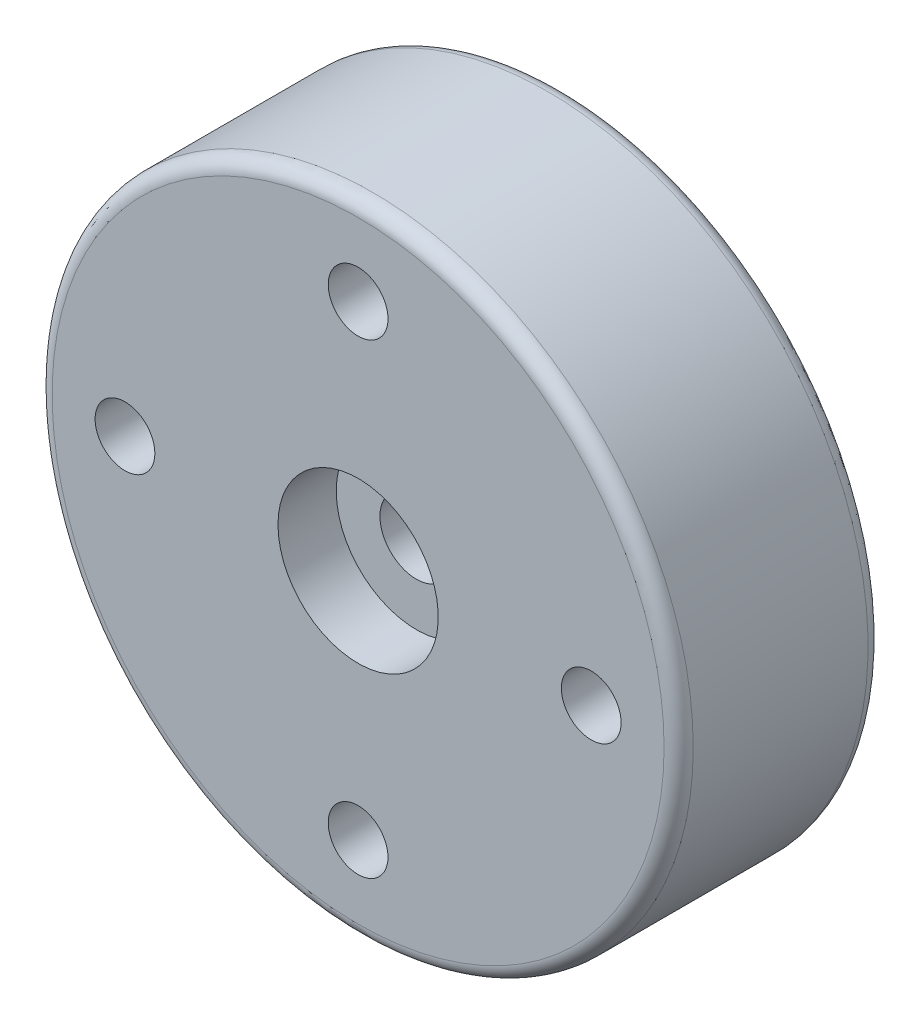
ISO-10303-21;
HEADER;
FILE_DESCRIPTION(('STEP AP214'),'2;1');
FILE_NAME('part.step','',(''),(''),'','','');
FILE_SCHEMA(('AUTOMOTIVE_DESIGN { 1 0 10303 214 1 1 1 1 }'));
ENDSEC;
DATA;
#1=APPLICATION_CONTEXT('core data for automotive mechanical design processes');
#2=APPLICATION_PROTOCOL_DEFINITION('international standard','automotive_design',2000,#1);
#3=PRODUCT_CONTEXT('',#1,'mechanical');
#4=PRODUCT('Part','Part','',(#3));
#5=PRODUCT_RELATED_PRODUCT_CATEGORY('part','',(#4));
#6=PRODUCT_DEFINITION_FORMATION('','',#4);
#7=PRODUCT_DEFINITION_CONTEXT('part definition',#1,'design');
#8=PRODUCT_DEFINITION('design','',#6,#7);
#9=PRODUCT_DEFINITION_SHAPE('','',#8);
#10=(LENGTH_UNIT() NAMED_UNIT(*) SI_UNIT(.MILLI.,.METRE.));
#11=(NAMED_UNIT(*) PLANE_ANGLE_UNIT() SI_UNIT($,.RADIAN.));
#12=(NAMED_UNIT(*) SI_UNIT($,.STERADIAN.) SOLID_ANGLE_UNIT());
#13=UNCERTAINTY_MEASURE_WITH_UNIT(LENGTH_MEASURE(1.E-05),#10,'distance_accuracy_value','');
#14=(GEOMETRIC_REPRESENTATION_CONTEXT(3) GLOBAL_UNCERTAINTY_ASSIGNED_CONTEXT((#13)) GLOBAL_UNIT_ASSIGNED_CONTEXT((#10,
#11,#12)) REPRESENTATION_CONTEXT('',''));
#15=CARTESIAN_POINT('',(0.,0.,0.));
#16=DIRECTION('',(0.,0.,1.));
#17=DIRECTION('',(1.,0.,0.));
#18=AXIS2_PLACEMENT_3D('',#15,#16,#17);
#19=CARTESIAN_POINT('',(0.,0.,0.));
#20=DIRECTION('',(0.,0.,-1.));
#21=DIRECTION('',(-1.,0.,0.));
#22=AXIS2_PLACEMENT_3D('',#19,#20,#21);
#23=CYLINDRICAL_SURFACE('',#22,2.75);
#24=CARTESIAN_POINT('',(0.,0.,-2.));
#25=DIRECTION('',(0.,0.,-1.));
#26=DIRECTION('',(-1.,0.,0.));
#27=AXIS2_PLACEMENT_3D('',#24,#25,#26);
#28=CIRCLE('',#27,2.75);
#29=CARTESIAN_POINT('',(-2.75,0.,-2.));
#30=VERTEX_POINT('',#29);
#31=EDGE_CURVE('E67',#30,#30,#28,.T.);
#32=ORIENTED_EDGE('',*,*,#31,.T.);
#33=EDGE_LOOP('',(#32));
#34=FACE_BOUND('',#33,.T.);
#35=CARTESIAN_POINT('',(0.,0.,0.));
#36=DIRECTION('',(0.,0.,-1.));
#37=DIRECTION('',(-1.,0.,0.));
#38=AXIS2_PLACEMENT_3D('',#35,#36,#37);
#39=CIRCLE('',#38,2.75);
#40=CARTESIAN_POINT('',(-2.75,0.,0.));
#41=VERTEX_POINT('',#40);
#42=EDGE_CURVE('E52',#41,#41,#39,.T.);
#43=ORIENTED_EDGE('',*,*,#42,.F.);
#44=EDGE_LOOP('',(#43));
#45=FACE_BOUND('',#44,.T.);
#46=ADVANCED_FACE('F32',(#34,#45),#23,.F.);
#47=CARTESIAN_POINT('',(0.,2.75,0.));
#48=DIRECTION('',(0.,0.,1.));
#49=DIRECTION('',(1.,0.,0.));
#50=AXIS2_PLACEMENT_3D('',#47,#48,#49);
#51=PLANE('',#50);
#52=CARTESIAN_POINT('',(0.,0.,0.));
#53=DIRECTION('',(0.,0.,1.));
#54=DIRECTION('',(1.,0.,0.));
#55=AXIS2_PLACEMENT_3D('',#52,#53,#54);
#56=CIRCLE('',#55,10.5);
#57=CARTESIAN_POINT('',(10.5,0.,0.));
#58=VERTEX_POINT('',#57);
#59=EDGE_CURVE('E10',#58,#58,#56,.T.);
#60=ORIENTED_EDGE('',*,*,#59,.T.);
#61=EDGE_LOOP('',(#60));
#62=FACE_BOUND('',#61,.T.);
#63=CARTESIAN_POINT('',(0.,8.,0.));
#64=DIRECTION('',(0.,0.,1.));
#65=DIRECTION('',(1.,0.,0.));
#66=AXIS2_PLACEMENT_3D('',#63,#64,#65);
#67=CIRCLE('',#66,1.025);
#68=CARTESIAN_POINT('',(1.025,8.,0.));
#69=VERTEX_POINT('',#68);
#70=EDGE_CURVE('E73',#69,#69,#67,.T.);
#71=ORIENTED_EDGE('',*,*,#70,.F.);
#72=EDGE_LOOP('',(#71));
#73=FACE_BOUND('',#72,.T.);
#74=CARTESIAN_POINT('',(8.,0.,0.));
#75=DIRECTION('',(0.,0.,1.));
#76=DIRECTION('',(1.,0.,0.));
#77=AXIS2_PLACEMENT_3D('',#74,#75,#76);
#78=CIRCLE('',#77,1.025);
#79=CARTESIAN_POINT('',(9.025,0.,0.));
#80=VERTEX_POINT('',#79);
#81=EDGE_CURVE('E85',#80,#80,#78,.T.);
#82=ORIENTED_EDGE('',*,*,#81,.F.);
#83=EDGE_LOOP('',(#82));
#84=FACE_BOUND('',#83,.T.);
#85=CARTESIAN_POINT('',(0.,-8.,0.));
#86=DIRECTION('',(0.,0.,1.));
#87=DIRECTION('',(1.,0.,0.));
#88=AXIS2_PLACEMENT_3D('',#85,#86,#87);
#89=CIRCLE('',#88,1.025);
#90=CARTESIAN_POINT('',(1.025,-8.,0.));
#91=VERTEX_POINT('',#90);
#92=EDGE_CURVE('E91',#91,#91,#89,.T.);
#93=ORIENTED_EDGE('',*,*,#92,.F.);
#94=EDGE_LOOP('',(#93));
#95=FACE_BOUND('',#94,.T.);
#96=CARTESIAN_POINT('',(-8.,0.,0.));
#97=DIRECTION('',(0.,0.,1.));
#98=DIRECTION('',(1.,0.,0.));
#99=AXIS2_PLACEMENT_3D('',#96,#97,#98);
#100=CIRCLE('',#99,1.025);
#101=CARTESIAN_POINT('',(-6.975,0.,0.));
#102=VERTEX_POINT('',#101);
#103=EDGE_CURVE('E79',#102,#102,#100,.T.);
#104=ORIENTED_EDGE('',*,*,#103,.F.);
#105=EDGE_LOOP('',(#104));
#106=FACE_BOUND('',#105,.T.);
#107=ORIENTED_EDGE('',*,*,#42,.T.);
#108=EDGE_LOOP('',(#107));
#109=FACE_BOUND('',#108,.T.);
#110=ADVANCED_FACE('F98',(#62,#73,#84,#95,#106,#109),#51,.T.);
#111=CARTESIAN_POINT('',(0.,0.,0.));
#112=DIRECTION('',(0.,0.,-1.));
#113=DIRECTION('',(-1.,0.,0.));
#114=AXIS2_PLACEMENT_3D('',#111,#112,#113);
#115=CYLINDRICAL_SURFACE('',#114,11.);
#116=CARTESIAN_POINT('',(0.,0.,-6.5));
#117=DIRECTION('',(0.,0.,-1.));
#118=DIRECTION('',(-1.,0.,0.));
#119=AXIS2_PLACEMENT_3D('',#116,#117,#118);
#120=CIRCLE('',#119,11.);
#121=CARTESIAN_POINT('',(-11.,0.,-6.5));
#122=VERTEX_POINT('',#121);
#123=EDGE_CURVE('E39',#122,#122,#120,.F.);
#124=ORIENTED_EDGE('',*,*,#123,.T.);
#125=EDGE_LOOP('',(#124));
#126=FACE_BOUND('',#125,.T.);
#127=CARTESIAN_POINT('',(0.,0.,-0.5));
#128=DIRECTION('',(0.,0.,1.));
#129=DIRECTION('',(1.,0.,0.));
#130=AXIS2_PLACEMENT_3D('',#127,#128,#129);
#131=CIRCLE('',#130,11.);
#132=CARTESIAN_POINT('',(11.,0.,-0.5));
#133=VERTEX_POINT('',#132);
#134=EDGE_CURVE('E43',#133,#133,#131,.F.);
#135=ORIENTED_EDGE('',*,*,#134,.T.);
#136=EDGE_LOOP('',(#135));
#137=FACE_BOUND('',#136,.T.);
#138=ADVANCED_FACE('F101',(#126,#137),#115,.T.);
#139=CARTESIAN_POINT('',(0.,11.,-7.));
#140=DIRECTION('',(0.,0.,-1.));
#141=DIRECTION('',(-1.,0.,0.));
#142=AXIS2_PLACEMENT_3D('',#139,#140,#141);
#143=PLANE('',#142);
#144=CARTESIAN_POINT('',(0.,0.,-7.));
#145=DIRECTION('',(0.,0.,-1.));
#146=DIRECTION('',(-1.,0.,0.));
#147=AXIS2_PLACEMENT_3D('',#144,#145,#146);
#148=CIRCLE('',#147,10.5);
#149=CARTESIAN_POINT('',(-10.5,0.,-7.));
#150=VERTEX_POINT('',#149);
#151=EDGE_CURVE('E47',#150,#150,#148,.T.);
#152=ORIENTED_EDGE('',*,*,#151,.T.);
#153=EDGE_LOOP('',(#152));
#154=FACE_BOUND('',#153,.T.);
#155=CARTESIAN_POINT('',(0.,8.,-7.));
#156=DIRECTION('',(0.,0.,-1.));
#157=DIRECTION('',(-1.,0.,0.));
#158=AXIS2_PLACEMENT_3D('',#155,#156,#157);
#159=CIRCLE('',#158,1.025);
#160=CARTESIAN_POINT('',(-1.025,8.,-7.));
#161=VERTEX_POINT('',#160);
#162=EDGE_CURVE('E70',#161,#161,#159,.F.);
#163=ORIENTED_EDGE('',*,*,#162,.T.);
#164=EDGE_LOOP('',(#163));
#165=FACE_BOUND('',#164,.T.);
#166=CARTESIAN_POINT('',(8.,0.,-7.));
#167=DIRECTION('',(0.,0.,-1.));
#168=DIRECTION('',(-1.,0.,0.));
#169=AXIS2_PLACEMENT_3D('',#166,#167,#168);
#170=CIRCLE('',#169,1.025);
#171=CARTESIAN_POINT('',(6.975,0.,-7.));
#172=VERTEX_POINT('',#171);
#173=EDGE_CURVE('E82',#172,#172,#170,.F.);
#174=ORIENTED_EDGE('',*,*,#173,.T.);
#175=EDGE_LOOP('',(#174));
#176=FACE_BOUND('',#175,.T.);
#177=CARTESIAN_POINT('',(0.,-8.,-7.));
#178=DIRECTION('',(0.,0.,-1.));
#179=DIRECTION('',(-1.,0.,0.));
#180=AXIS2_PLACEMENT_3D('',#177,#178,#179);
#181=CIRCLE('',#180,1.025);
#182=CARTESIAN_POINT('',(-1.025,-8.,-7.));
#183=VERTEX_POINT('',#182);
#184=EDGE_CURVE('E88',#183,#183,#181,.F.);
#185=ORIENTED_EDGE('',*,*,#184,.T.);
#186=EDGE_LOOP('',(#185));
#187=FACE_BOUND('',#186,.T.);
#188=CARTESIAN_POINT('',(-8.,0.,-7.));
#189=DIRECTION('',(0.,0.,-1.));
#190=DIRECTION('',(-1.,0.,0.));
#191=AXIS2_PLACEMENT_3D('',#188,#189,#190);
#192=CIRCLE('',#191,1.025);
#193=CARTESIAN_POINT('',(-9.025,0.,-7.));
#194=VERTEX_POINT('',#193);
#195=EDGE_CURVE('E76',#194,#194,#192,.F.);
#196=ORIENTED_EDGE('',*,*,#195,.T.);
#197=EDGE_LOOP('',(#196));
#198=FACE_BOUND('',#197,.T.);
#199=CARTESIAN_POINT('',(0.,0.,-7.));
#200=DIRECTION('',(0.,0.,-1.));
#201=DIRECTION('',(-1.,0.,0.));
#202=AXIS2_PLACEMENT_3D('',#199,#200,#201);
#203=CIRCLE('',#202,2.75);
#204=CARTESIAN_POINT('',(-2.75,0.,-7.));
#205=VERTEX_POINT('',#204);
#206=EDGE_CURVE('E55',#205,#205,#203,.T.);
#207=ORIENTED_EDGE('',*,*,#206,.F.);
#208=EDGE_LOOP('',(#207));
#209=FACE_BOUND('',#208,.T.);
#210=ADVANCED_FACE('F129',(#154,#165,#176,#187,#198,#209),#143,.T.);
#211=CARTESIAN_POINT('',(0.,0.,0.));
#212=DIRECTION('',(0.,0.,-1.));
#213=DIRECTION('',(-1.,0.,0.));
#214=AXIS2_PLACEMENT_3D('',#211,#212,#213);
#215=CYLINDRICAL_SURFACE('',#214,2.75);
#216=ORIENTED_EDGE('',*,*,#206,.T.);
#217=EDGE_LOOP('',(#216));
#218=FACE_BOUND('',#217,.T.);
#219=CARTESIAN_POINT('',(0.,0.,-3.5));
#220=DIRECTION('',(0.,0.,-1.));
#221=DIRECTION('',(-1.,0.,0.));
#222=AXIS2_PLACEMENT_3D('',#219,#220,#221);
#223=CIRCLE('',#222,2.75);
#224=CARTESIAN_POINT('',(-2.75,0.,-3.5));
#225=VERTEX_POINT('',#224);
#226=EDGE_CURVE('E58',#225,#225,#223,.T.);
#227=ORIENTED_EDGE('',*,*,#226,.F.);
#228=EDGE_LOOP('',(#227));
#229=FACE_BOUND('',#228,.T.);
#230=ADVANCED_FACE('F132',(#218,#229),#215,.F.);
#231=CARTESIAN_POINT('',(0.,2.75,-3.5));
#232=DIRECTION('',(0.,0.,-1.));
#233=DIRECTION('',(-1.,0.,0.));
#234=AXIS2_PLACEMENT_3D('',#231,#232,#233);
#235=PLANE('',#234);
#236=ORIENTED_EDGE('',*,*,#226,.T.);
#237=EDGE_LOOP('',(#236));
#238=FACE_BOUND('',#237,.T.);
#239=CARTESIAN_POINT('',(0.,0.,-3.5));
#240=DIRECTION('',(0.,0.,-1.));
#241=DIRECTION('',(-1.,0.,0.));
#242=AXIS2_PLACEMENT_3D('',#239,#240,#241);
#243=CIRCLE('',#242,1.25);
#244=CARTESIAN_POINT('',(-1.25,0.,-3.5));
#245=VERTEX_POINT('',#244);
#246=EDGE_CURVE('E61',#245,#245,#243,.T.);
#247=ORIENTED_EDGE('',*,*,#246,.F.);
#248=EDGE_LOOP('',(#247));
#249=FACE_BOUND('',#248,.T.);
#250=ADVANCED_FACE('F146',(#238,#249),#235,.T.);
#251=CARTESIAN_POINT('',(0.,0.,0.));
#252=DIRECTION('',(0.,0.,-1.));
#253=DIRECTION('',(-1.,0.,0.));
#254=AXIS2_PLACEMENT_3D('',#251,#252,#253);
#255=CYLINDRICAL_SURFACE('',#254,1.25);
#256=ORIENTED_EDGE('',*,*,#246,.T.);
#257=EDGE_LOOP('',(#256));
#258=FACE_BOUND('',#257,.T.);
#259=CARTESIAN_POINT('',(0.,0.,-2.));
#260=DIRECTION('',(0.,0.,-1.));
#261=DIRECTION('',(-1.,0.,0.));
#262=AXIS2_PLACEMENT_3D('',#259,#260,#261);
#263=CIRCLE('',#262,1.25);
#264=CARTESIAN_POINT('',(-1.25,0.,-2.));
#265=VERTEX_POINT('',#264);
#266=EDGE_CURVE('E64',#265,#265,#263,.T.);
#267=ORIENTED_EDGE('',*,*,#266,.F.);
#268=EDGE_LOOP('',(#267));
#269=FACE_BOUND('',#268,.T.);
#270=ADVANCED_FACE('F123',(#258,#269),#255,.F.);
#271=CARTESIAN_POINT('',(0.,2.75,-2.));
#272=DIRECTION('',(0.,0.,1.));
#273=DIRECTION('',(1.,0.,0.));
#274=AXIS2_PLACEMENT_3D('',#271,#272,#273);
#275=PLANE('',#274);
#276=ORIENTED_EDGE('',*,*,#266,.T.);
#277=EDGE_LOOP('',(#276));
#278=FACE_BOUND('',#277,.T.);
#279=ORIENTED_EDGE('',*,*,#31,.F.);
#280=EDGE_LOOP('',(#279));
#281=FACE_BOUND('',#280,.T.);
#282=ADVANCED_FACE('F115',(#278,#281),#275,.T.);
#283=CARTESIAN_POINT('',(0.,0.,-6.5));
#284=DIRECTION('',(0.,0.,-1.));
#285=DIRECTION('',(-1.,0.,0.));
#286=AXIS2_PLACEMENT_3D('',#283,#284,#285);
#287=TOROIDAL_SURFACE('',#286,10.5,0.5);
#288=ORIENTED_EDGE('',*,*,#123,.F.);
#289=EDGE_LOOP('',(#288));
#290=FACE_BOUND('',#289,.T.);
#291=ORIENTED_EDGE('',*,*,#151,.F.);
#292=EDGE_LOOP('',(#291));
#293=FACE_BOUND('',#292,.T.);
#294=ADVANCED_FACE('F113',(#290,#293),#287,.T.);
#295=CARTESIAN_POINT('',(0.,0.,-0.5));
#296=DIRECTION('',(0.,0.,1.));
#297=DIRECTION('',(1.,0.,0.));
#298=AXIS2_PLACEMENT_3D('',#295,#296,#297);
#299=TOROIDAL_SURFACE('',#298,10.5,0.5);
#300=ORIENTED_EDGE('',*,*,#59,.F.);
#301=EDGE_LOOP('',(#300));
#302=FACE_BOUND('',#301,.T.);
#303=ORIENTED_EDGE('',*,*,#134,.F.);
#304=EDGE_LOOP('',(#303));
#305=FACE_BOUND('',#304,.T.);
#306=ADVANCED_FACE('F34',(#302,#305),#299,.T.);
#307=CARTESIAN_POINT('',(0.,8.,-10.));
#308=DIRECTION('',(0.,0.,1.));
#309=DIRECTION('',(1.,0.,0.));
#310=AXIS2_PLACEMENT_3D('',#307,#308,#309);
#311=CYLINDRICAL_SURFACE('',#310,1.025);
#312=ORIENTED_EDGE('',*,*,#70,.T.);
#313=EDGE_LOOP('',(#312));
#314=FACE_BOUND('',#313,.T.);
#315=ORIENTED_EDGE('',*,*,#162,.F.);
#316=EDGE_LOOP('',(#315));
#317=FACE_BOUND('',#316,.T.);
#318=ADVANCED_FACE('F121',(#314,#317),#311,.F.);
#319=CARTESIAN_POINT('',(-8.,0.,-10.));
#320=DIRECTION('',(0.,0.,1.));
#321=DIRECTION('',(1.,0.,0.));
#322=AXIS2_PLACEMENT_3D('',#319,#320,#321);
#323=CYLINDRICAL_SURFACE('',#322,1.025);
#324=ORIENTED_EDGE('',*,*,#103,.T.);
#325=EDGE_LOOP('',(#324));
#326=FACE_BOUND('',#325,.T.);
#327=ORIENTED_EDGE('',*,*,#195,.F.);
#328=EDGE_LOOP('',(#327));
#329=FACE_BOUND('',#328,.T.);
#330=ADVANCED_FACE('F227',(#326,#329),#323,.F.);
#331=CARTESIAN_POINT('',(8.,0.,-10.));
#332=DIRECTION('',(0.,0.,1.));
#333=DIRECTION('',(1.,0.,0.));
#334=AXIS2_PLACEMENT_3D('',#331,#332,#333);
#335=CYLINDRICAL_SURFACE('',#334,1.025);
#336=ORIENTED_EDGE('',*,*,#81,.T.);
#337=EDGE_LOOP('',(#336));
#338=FACE_BOUND('',#337,.T.);
#339=ORIENTED_EDGE('',*,*,#173,.F.);
#340=EDGE_LOOP('',(#339));
#341=FACE_BOUND('',#340,.T.);
#342=ADVANCED_FACE('F235',(#338,#341),#335,.F.);
#343=CARTESIAN_POINT('',(0.,-8.,-10.));
#344=DIRECTION('',(0.,0.,1.));
#345=DIRECTION('',(1.,0.,0.));
#346=AXIS2_PLACEMENT_3D('',#343,#344,#345);
#347=CYLINDRICAL_SURFACE('',#346,1.025);
#348=ORIENTED_EDGE('',*,*,#92,.T.);
#349=EDGE_LOOP('',(#348));
#350=FACE_BOUND('',#349,.T.);
#351=ORIENTED_EDGE('',*,*,#184,.F.);
#352=EDGE_LOOP('',(#351));
#353=FACE_BOUND('',#352,.T.);
#354=ADVANCED_FACE('F95',(#350,#353),#347,.F.);
#355=CLOSED_SHELL('',(#46,#110,#138,#210,#230,#250,#270,#282,#294,#306,#318,#330,#342,#354));
#356=MANIFOLD_SOLID_BREP('B2',#355);
#357=ADVANCED_BREP_SHAPE_REPRESENTATION('',(#18,#356),#14);
#358=SHAPE_DEFINITION_REPRESENTATION(#9,#357);
ENDSEC;
END-ISO-10303-21;
